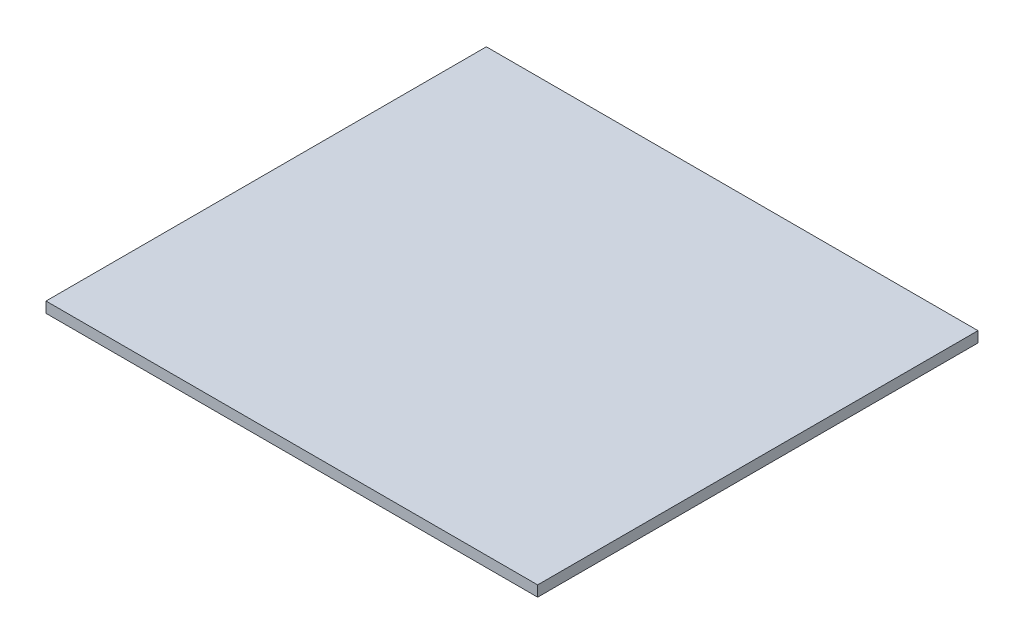
ISO-10303-21;
HEADER;
FILE_DESCRIPTION(('STEP AP214'),'2;1');
FILE_NAME('part.step','',(''),(''),'','','');
FILE_SCHEMA(('AUTOMOTIVE_DESIGN { 1 0 10303 214 1 1 1 1 }'));
ENDSEC;
DATA;
#1=APPLICATION_CONTEXT('core data for automotive mechanical design processes');
#2=APPLICATION_PROTOCOL_DEFINITION('international standard','automotive_design',2000,#1);
#3=PRODUCT_CONTEXT('',#1,'mechanical');
#4=PRODUCT('Part','Part','',(#3));
#5=PRODUCT_RELATED_PRODUCT_CATEGORY('part','',(#4));
#6=PRODUCT_DEFINITION_FORMATION('','',#4);
#7=PRODUCT_DEFINITION_CONTEXT('part definition',#1,'design');
#8=PRODUCT_DEFINITION('design','',#6,#7);
#9=PRODUCT_DEFINITION_SHAPE('','',#8);
#10=(LENGTH_UNIT() NAMED_UNIT(*) SI_UNIT(.MILLI.,.METRE.));
#11=(NAMED_UNIT(*) PLANE_ANGLE_UNIT() SI_UNIT($,.RADIAN.));
#12=(NAMED_UNIT(*) SI_UNIT($,.STERADIAN.) SOLID_ANGLE_UNIT());
#13=UNCERTAINTY_MEASURE_WITH_UNIT(LENGTH_MEASURE(1.E-05),#10,'distance_accuracy_value','');
#14=(GEOMETRIC_REPRESENTATION_CONTEXT(3) GLOBAL_UNCERTAINTY_ASSIGNED_CONTEXT((#13)) GLOBAL_UNIT_ASSIGNED_CONTEXT((#10,
#11,#12)) REPRESENTATION_CONTEXT('',''));
#15=CARTESIAN_POINT('',(0.,0.,0.));
#16=DIRECTION('',(0.,0.,1.));
#17=DIRECTION('',(1.,0.,0.));
#18=AXIS2_PLACEMENT_3D('',#15,#16,#17);
#19=CARTESIAN_POINT('',(57.5,2.5,51.5));
#20=DIRECTION('',(-1.,0.,0.));
#21=DIRECTION('',(0.,0.,1.));
#22=AXIS2_PLACEMENT_3D('',#19,#20,#21);
#23=PLANE('',#22);
#24=DIRECTION('',(0.,0.,-1.));
#25=VECTOR('',#24,1.);
#26=CARTESIAN_POINT('',(57.5,0.,51.5));
#27=LINE('',#26,#25);
#28=CARTESIAN_POINT('',(57.5,0.,51.5));
#29=VERTEX_POINT('',#28);
#30=CARTESIAN_POINT('',(57.5,0.,-51.5));
#31=VERTEX_POINT('',#30);
#32=EDGE_CURVE('E98',#29,#31,#27,.T.);
#33=ORIENTED_EDGE('',*,*,#32,.T.);
#34=DIRECTION('',(0.,-1.,0.));
#35=VECTOR('',#34,1.);
#36=CARTESIAN_POINT('',(57.5,2.5,-51.5));
#37=LINE('',#36,#35);
#38=CARTESIAN_POINT('',(57.5,2.5,-51.5));
#39=VERTEX_POINT('',#38);
#40=EDGE_CURVE('E11',#39,#31,#37,.T.);
#41=ORIENTED_EDGE('',*,*,#40,.F.);
#42=DIRECTION('',(0.,0.,-1.));
#43=VECTOR('',#42,1.);
#44=CARTESIAN_POINT('',(57.5,2.5,51.5));
#45=LINE('',#44,#43);
#46=CARTESIAN_POINT('',(57.5,2.5,51.5));
#47=VERTEX_POINT('',#46);
#48=EDGE_CURVE('E86',#47,#39,#45,.T.);
#49=ORIENTED_EDGE('',*,*,#48,.F.);
#50=DIRECTION('',(0.,-1.,0.));
#51=VECTOR('',#50,1.);
#52=CARTESIAN_POINT('',(57.5,2.5,51.5));
#53=LINE('',#52,#51);
#54=EDGE_CURVE('E94',#47,#29,#53,.T.);
#55=ORIENTED_EDGE('',*,*,#54,.T.);
#56=EDGE_LOOP('',(#33,#41,#49,#55));
#57=FACE_BOUND('',#56,.T.);
#58=ADVANCED_FACE('F35',(#57),#23,.F.);
#59=CARTESIAN_POINT('',(-57.5,2.5,-51.5));
#60=DIRECTION('',(0.,0.,1.));
#61=DIRECTION('',(1.,0.,0.));
#62=AXIS2_PLACEMENT_3D('',#59,#60,#61);
#63=PLANE('',#62);
#64=DIRECTION('',(-1.,0.,0.));
#65=VECTOR('',#64,1.);
#66=CARTESIAN_POINT('',(-57.5,0.,-51.5));
#67=LINE('',#66,#65);
#68=CARTESIAN_POINT('',(-57.5,0.,-51.5));
#69=VERTEX_POINT('',#68);
#70=EDGE_CURVE('E90',#31,#69,#67,.T.);
#71=ORIENTED_EDGE('',*,*,#70,.T.);
#72=DIRECTION('',(0.,-1.,0.));
#73=VECTOR('',#72,1.);
#74=CARTESIAN_POINT('',(-57.5,2.5,-51.5));
#75=LINE('',#74,#73);
#76=CARTESIAN_POINT('',(-57.5,2.5,-51.5));
#77=VERTEX_POINT('',#76);
#78=EDGE_CURVE('E43',#77,#69,#75,.T.);
#79=ORIENTED_EDGE('',*,*,#78,.F.);
#80=DIRECTION('',(-1.,0.,0.));
#81=VECTOR('',#80,1.);
#82=CARTESIAN_POINT('',(-57.5,2.5,-51.5));
#83=LINE('',#82,#81);
#84=EDGE_CURVE('E81',#39,#77,#83,.T.);
#85=ORIENTED_EDGE('',*,*,#84,.F.);
#86=ORIENTED_EDGE('',*,*,#40,.T.);
#87=EDGE_LOOP('',(#71,#79,#85,#86));
#88=FACE_BOUND('',#87,.T.);
#89=ADVANCED_FACE('F89',(#88),#63,.F.);
#90=CARTESIAN_POINT('',(-57.5,2.5,51.5));
#91=DIRECTION('',(1.,0.,0.));
#92=DIRECTION('',(0.,0.,-1.));
#93=AXIS2_PLACEMENT_3D('',#90,#91,#92);
#94=PLANE('',#93);
#95=DIRECTION('',(0.,0.,1.));
#96=VECTOR('',#95,1.);
#97=CARTESIAN_POINT('',(-57.5,0.,51.5));
#98=LINE('',#97,#96);
#99=CARTESIAN_POINT('',(-57.5,0.,51.5));
#100=VERTEX_POINT('',#99);
#101=EDGE_CURVE('E68',#69,#100,#98,.T.);
#102=ORIENTED_EDGE('',*,*,#101,.T.);
#103=DIRECTION('',(0.,-1.,0.));
#104=VECTOR('',#103,1.);
#105=CARTESIAN_POINT('',(-57.5,2.5,51.5));
#106=LINE('',#105,#104);
#107=CARTESIAN_POINT('',(-57.5,2.5,51.5));
#108=VERTEX_POINT('',#107);
#109=EDGE_CURVE('E91',#108,#100,#106,.T.);
#110=ORIENTED_EDGE('',*,*,#109,.F.);
#111=DIRECTION('',(0.,0.,1.));
#112=VECTOR('',#111,1.);
#113=CARTESIAN_POINT('',(-57.5,2.5,51.5));
#114=LINE('',#113,#112);
#115=EDGE_CURVE('E84',#77,#108,#114,.T.);
#116=ORIENTED_EDGE('',*,*,#115,.F.);
#117=ORIENTED_EDGE('',*,*,#78,.T.);
#118=EDGE_LOOP('',(#102,#110,#116,#117));
#119=FACE_BOUND('',#118,.T.);
#120=ADVANCED_FACE('F92',(#119),#94,.F.);
#121=CARTESIAN_POINT('',(-57.5,2.5,51.5));
#122=DIRECTION('',(0.,0.,-1.));
#123=DIRECTION('',(-1.,0.,0.));
#124=AXIS2_PLACEMENT_3D('',#121,#122,#123);
#125=PLANE('',#124);
#126=DIRECTION('',(1.,0.,0.));
#127=VECTOR('',#126,1.);
#128=CARTESIAN_POINT('',(-57.5,0.,51.5));
#129=LINE('',#128,#127);
#130=EDGE_CURVE('E74',#100,#29,#129,.T.);
#131=ORIENTED_EDGE('',*,*,#130,.T.);
#132=ORIENTED_EDGE('',*,*,#54,.F.);
#133=DIRECTION('',(1.,0.,0.));
#134=VECTOR('',#133,1.);
#135=CARTESIAN_POINT('',(-57.5,2.5,51.5));
#136=LINE('',#135,#134);
#137=EDGE_CURVE('E51',#108,#47,#136,.T.);
#138=ORIENTED_EDGE('',*,*,#137,.F.);
#139=ORIENTED_EDGE('',*,*,#109,.T.);
#140=EDGE_LOOP('',(#131,#132,#138,#139));
#141=FACE_BOUND('',#140,.T.);
#142=ADVANCED_FACE('F105',(#141),#125,.F.);
#143=CARTESIAN_POINT('',(0.,2.5,0.));
#144=DIRECTION('',(0.,-1.,0.));
#145=DIRECTION('',(0.,0.,-1.));
#146=AXIS2_PLACEMENT_3D('',#143,#144,#145);
#147=PLANE('',#146);
#148=ORIENTED_EDGE('',*,*,#48,.T.);
#149=ORIENTED_EDGE('',*,*,#84,.T.);
#150=ORIENTED_EDGE('',*,*,#115,.T.);
#151=ORIENTED_EDGE('',*,*,#137,.T.);
#152=EDGE_LOOP('',(#148,#149,#150,#151));
#153=FACE_BOUND('',#152,.T.);
#154=ADVANCED_FACE('F82',(#153),#147,.F.);
#155=CARTESIAN_POINT('',(0.,0.,0.));
#156=DIRECTION('',(0.,-1.,0.));
#157=DIRECTION('',(0.,0.,-1.));
#158=AXIS2_PLACEMENT_3D('',#155,#156,#157);
#159=PLANE('',#158);
#160=ORIENTED_EDGE('',*,*,#32,.F.);
#161=ORIENTED_EDGE('',*,*,#130,.F.);
#162=ORIENTED_EDGE('',*,*,#101,.F.);
#163=ORIENTED_EDGE('',*,*,#70,.F.);
#164=EDGE_LOOP('',(#160,#161,#162,#163));
#165=FACE_BOUND('',#164,.T.);
#166=ADVANCED_FACE('F108',(#165),#159,.T.);
#167=CLOSED_SHELL('',(#58,#89,#120,#142,#154,#166));
#168=MANIFOLD_SOLID_BREP('B2',#167);
#169=ADVANCED_BREP_SHAPE_REPRESENTATION('',(#18,#168),#14);
#170=SHAPE_DEFINITION_REPRESENTATION(#9,#169);
ENDSEC;
END-ISO-10303-21;
